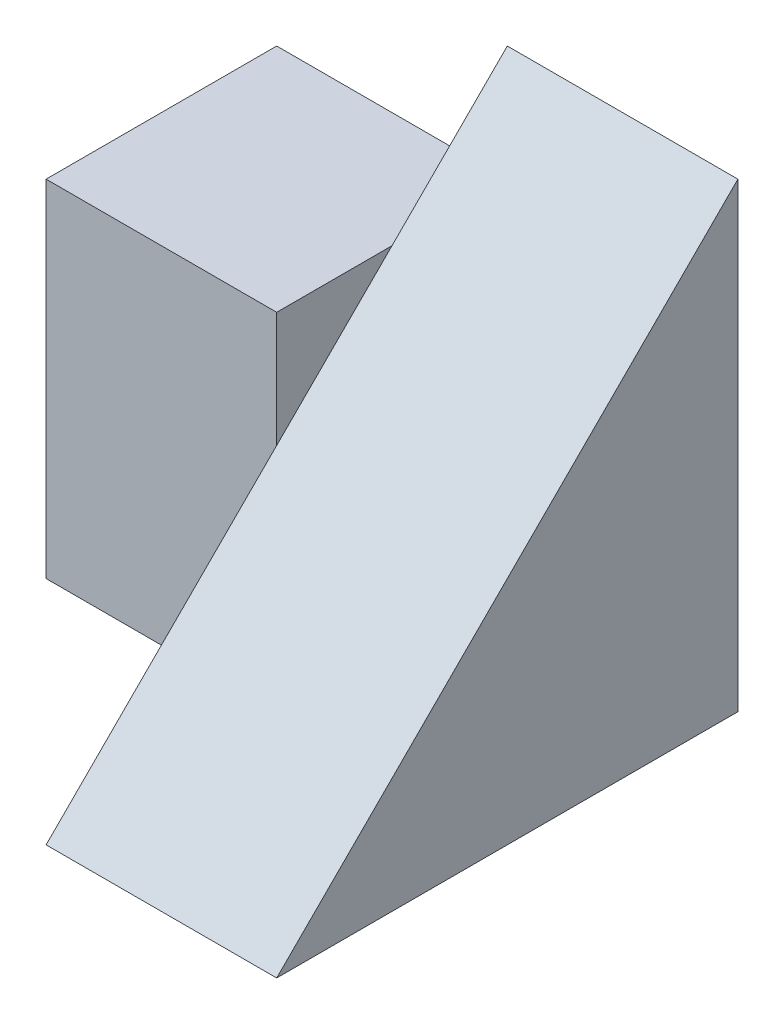
ISO-10303-21;
HEADER;
FILE_DESCRIPTION(('STEP AP214'),'2;1');
FILE_NAME('part.step','',(''),(''),'','','');
FILE_SCHEMA(('AUTOMOTIVE_DESIGN { 1 0 10303 214 1 1 1 1 }'));
ENDSEC;
DATA;
#1=APPLICATION_CONTEXT('core data for automotive mechanical design processes');
#2=APPLICATION_PROTOCOL_DEFINITION('international standard','automotive_design',2000,#1);
#3=PRODUCT_CONTEXT('',#1,'mechanical');
#4=PRODUCT('Part','Part','',(#3));
#5=PRODUCT_RELATED_PRODUCT_CATEGORY('part','',(#4));
#6=PRODUCT_DEFINITION_FORMATION('','',#4);
#7=PRODUCT_DEFINITION_CONTEXT('part definition',#1,'design');
#8=PRODUCT_DEFINITION('design','',#6,#7);
#9=PRODUCT_DEFINITION_SHAPE('','',#8);
#10=(LENGTH_UNIT() NAMED_UNIT(*) SI_UNIT(.MILLI.,.METRE.));
#11=(NAMED_UNIT(*) PLANE_ANGLE_UNIT() SI_UNIT($,.RADIAN.));
#12=(NAMED_UNIT(*) SI_UNIT($,.STERADIAN.) SOLID_ANGLE_UNIT());
#13=UNCERTAINTY_MEASURE_WITH_UNIT(LENGTH_MEASURE(1.E-05),#10,'distance_accuracy_value','');
#14=(GEOMETRIC_REPRESENTATION_CONTEXT(3) GLOBAL_UNCERTAINTY_ASSIGNED_CONTEXT((#13)) GLOBAL_UNIT_ASSIGNED_CONTEXT((#10,
#11,#12)) REPRESENTATION_CONTEXT('',''));
#15=CARTESIAN_POINT('',(0.,0.,0.));
#16=DIRECTION('',(0.,0.,1.));
#17=DIRECTION('',(1.,0.,0.));
#18=AXIS2_PLACEMENT_3D('',#15,#16,#17);
#19=CARTESIAN_POINT('',(0.,0.,0.));
#20=DIRECTION('',(-1.,0.,0.));
#21=DIRECTION('',(0.,0.,1.));
#22=AXIS2_PLACEMENT_3D('',#19,#20,#21);
#23=PLANE('',#22);
#24=DIRECTION('',(0.,0.707106781186548,-0.707106781186548));
#25=VECTOR('',#24,1.);
#26=CARTESIAN_POINT('',(0.,4.,-4.));
#27=LINE('',#26,#25);
#28=CARTESIAN_POINT('',(0.,3.,-3.));
#29=VERTEX_POINT('',#28);
#30=CARTESIAN_POINT('',(0.,4.,-4.));
#31=VERTEX_POINT('',#30);
#32=EDGE_CURVE('E100',#29,#31,#27,.T.);
#33=ORIENTED_EDGE('',*,*,#32,.T.);
#34=DIRECTION('',(0.,1.,0.));
#35=VECTOR('',#34,1.);
#36=CARTESIAN_POINT('',(0.,0.,-4.));
#37=LINE('',#36,#35);
#38=CARTESIAN_POINT('',(0.,3.,-4.));
#39=VERTEX_POINT('',#38);
#40=EDGE_CURVE('E106',#39,#31,#37,.T.);
#41=ORIENTED_EDGE('',*,*,#40,.F.);
#42=DIRECTION('',(0.,0.,-1.));
#43=VECTOR('',#42,1.);
#44=CARTESIAN_POINT('',(0.,3.,-4.));
#45=LINE('',#44,#43);
#46=EDGE_CURVE('E37',#29,#39,#45,.T.);
#47=ORIENTED_EDGE('',*,*,#46,.F.);
#48=EDGE_LOOP('',(#33,#41,#47));
#49=FACE_BOUND('',#48,.T.);
#50=ADVANCED_FACE('F33',(#49),#23,.T.);
#51=CARTESIAN_POINT('',(2.,0.,0.));
#52=DIRECTION('',(0.,1.,0.));
#53=DIRECTION('',(0.,0.,1.));
#54=AXIS2_PLACEMENT_3D('',#51,#52,#53);
#55=PLANE('',#54);
#56=DIRECTION('',(0.,0.,-1.));
#57=VECTOR('',#56,1.);
#58=CARTESIAN_POINT('',(0.,0.,0.));
#59=LINE('',#58,#57);
#60=CARTESIAN_POINT('',(0.,0.,0.));
#61=VERTEX_POINT('',#60);
#62=CARTESIAN_POINT('',(0.,0.,-2.));
#63=VERTEX_POINT('',#62);
#64=EDGE_CURVE('E101',#61,#63,#59,.T.);
#65=ORIENTED_EDGE('',*,*,#64,.T.);
#66=DIRECTION('',(1.,0.,0.));
#67=VECTOR('',#66,1.);
#68=CARTESIAN_POINT('',(-2.,0.,-2.));
#69=LINE('',#68,#67);
#70=CARTESIAN_POINT('',(-2.,0.,-2.));
#71=VERTEX_POINT('',#70);
#72=EDGE_CURVE('E107',#71,#63,#69,.T.);
#73=ORIENTED_EDGE('',*,*,#72,.F.);
#74=DIRECTION('',(0.,0.,1.));
#75=VECTOR('',#74,1.);
#76=CARTESIAN_POINT('',(-2.,0.,-4.));
#77=LINE('',#76,#75);
#78=CARTESIAN_POINT('',(-2.,0.,-4.));
#79=VERTEX_POINT('',#78);
#80=EDGE_CURVE('E148',#79,#71,#77,.T.);
#81=ORIENTED_EDGE('',*,*,#80,.F.);
#82=DIRECTION('',(-1.,0.,0.));
#83=VECTOR('',#82,1.);
#84=CARTESIAN_POINT('',(2.,0.,-4.));
#85=LINE('',#84,#83);
#86=CARTESIAN_POINT('',(2.,0.,-4.));
#87=VERTEX_POINT('',#86);
#88=EDGE_CURVE('E43',#87,#79,#85,.T.);
#89=ORIENTED_EDGE('',*,*,#88,.F.);
#90=DIRECTION('',(0.,0.,-1.));
#91=VECTOR('',#90,1.);
#92=CARTESIAN_POINT('',(2.,0.,0.));
#93=LINE('',#92,#91);
#94=CARTESIAN_POINT('',(2.,0.,0.));
#95=VERTEX_POINT('',#94);
#96=EDGE_CURVE('E111',#95,#87,#93,.T.);
#97=ORIENTED_EDGE('',*,*,#96,.F.);
#98=DIRECTION('',(-1.,0.,0.));
#99=VECTOR('',#98,1.);
#100=CARTESIAN_POINT('',(2.,0.,0.));
#101=LINE('',#100,#99);
#102=EDGE_CURVE('E11',#95,#61,#101,.T.);
#103=ORIENTED_EDGE('',*,*,#102,.T.);
#104=EDGE_LOOP('',(#65,#73,#81,#89,#97,#103));
#105=FACE_BOUND('',#104,.T.);
#106=ADVANCED_FACE('F35',(#105),#55,.F.);
#107=CARTESIAN_POINT('',(2.,0.,-4.));
#108=DIRECTION('',(0.,0.,1.));
#109=DIRECTION('',(1.,0.,0.));
#110=AXIS2_PLACEMENT_3D('',#107,#108,#109);
#111=PLANE('',#110);
#112=ORIENTED_EDGE('',*,*,#88,.T.);
#113=DIRECTION('',(0.,-1.,0.));
#114=VECTOR('',#113,1.);
#115=CARTESIAN_POINT('',(-2.,0.,-4.));
#116=LINE('',#115,#114);
#117=CARTESIAN_POINT('',(-2.,3.,-4.));
#118=VERTEX_POINT('',#117);
#119=EDGE_CURVE('E139',#118,#79,#116,.T.);
#120=ORIENTED_EDGE('',*,*,#119,.F.);
#121=DIRECTION('',(1.,0.,0.));
#122=VECTOR('',#121,1.);
#123=CARTESIAN_POINT('',(-2.,3.,-4.));
#124=LINE('',#123,#122);
#125=EDGE_CURVE('E140',#118,#39,#124,.T.);
#126=ORIENTED_EDGE('',*,*,#125,.T.);
#127=ORIENTED_EDGE('',*,*,#40,.T.);
#128=DIRECTION('',(-1.,0.,0.));
#129=VECTOR('',#128,1.);
#130=CARTESIAN_POINT('',(2.,4.,-4.));
#131=LINE('',#130,#129);
#132=CARTESIAN_POINT('',(2.,4.,-4.));
#133=VERTEX_POINT('',#132);
#134=EDGE_CURVE('E118',#133,#31,#131,.T.);
#135=ORIENTED_EDGE('',*,*,#134,.F.);
#136=DIRECTION('',(0.,1.,0.));
#137=VECTOR('',#136,1.);
#138=CARTESIAN_POINT('',(2.,0.,-4.));
#139=LINE('',#138,#137);
#140=EDGE_CURVE('E116',#87,#133,#139,.T.);
#141=ORIENTED_EDGE('',*,*,#140,.F.);
#142=EDGE_LOOP('',(#112,#120,#126,#127,#135,#141));
#143=FACE_BOUND('',#142,.T.);
#144=ADVANCED_FACE('F161',(#143),#111,.F.);
#145=CARTESIAN_POINT('',(2.,0.,0.));
#146=DIRECTION('',(-1.,0.,0.));
#147=DIRECTION('',(0.,0.,1.));
#148=AXIS2_PLACEMENT_3D('',#145,#146,#147);
#149=PLANE('',#148);
#150=ORIENTED_EDGE('',*,*,#140,.T.);
#151=DIRECTION('',(0.,0.707106781186548,-0.707106781186548));
#152=VECTOR('',#151,1.);
#153=CARTESIAN_POINT('',(2.,4.,-4.));
#154=LINE('',#153,#152);
#155=EDGE_CURVE('E153',#95,#133,#154,.T.);
#156=ORIENTED_EDGE('',*,*,#155,.F.);
#157=ORIENTED_EDGE('',*,*,#96,.T.);
#158=EDGE_LOOP('',(#150,#156,#157));
#159=FACE_BOUND('',#158,.T.);
#160=ADVANCED_FACE('F193',(#159),#149,.F.);
#161=CARTESIAN_POINT('',(0.,2.,-2.));
#162=VERTEX_POINT('',#161);
#163=EDGE_CURVE('E95',#61,#162,#27,.T.);
#164=ORIENTED_EDGE('',*,*,#163,.T.);
#165=DIRECTION('',(0.,1.,0.));
#166=VECTOR('',#165,1.);
#167=CARTESIAN_POINT('',(0.,0.,-2.));
#168=LINE('',#167,#166);
#169=EDGE_CURVE('E59',#63,#162,#168,.T.);
#170=ORIENTED_EDGE('',*,*,#169,.F.);
#171=ORIENTED_EDGE('',*,*,#64,.F.);
#172=EDGE_LOOP('',(#164,#170,#171));
#173=FACE_BOUND('',#172,.T.);
#174=ADVANCED_FACE('F102',(#173),#23,.T.);
#175=CARTESIAN_POINT('',(-2.,0.,-2.));
#176=DIRECTION('',(0.,0.,-1.));
#177=DIRECTION('',(-1.,0.,0.));
#178=AXIS2_PLACEMENT_3D('',#175,#176,#177);
#179=PLANE('',#178);
#180=ORIENTED_EDGE('',*,*,#169,.T.);
#181=DIRECTION('',(0.,-1.,0.));
#182=VECTOR('',#181,1.);
#183=CARTESIAN_POINT('',(0.,0.,-2.));
#184=LINE('',#183,#182);
#185=CARTESIAN_POINT('',(0.,3.,-2.));
#186=VERTEX_POINT('',#185);
#187=EDGE_CURVE('E98',#186,#162,#184,.T.);
#188=ORIENTED_EDGE('',*,*,#187,.F.);
#189=DIRECTION('',(1.,0.,0.));
#190=VECTOR('',#189,1.);
#191=CARTESIAN_POINT('',(-2.,3.,-2.));
#192=LINE('',#191,#190);
#193=CARTESIAN_POINT('',(-2.,3.,-2.));
#194=VERTEX_POINT('',#193);
#195=EDGE_CURVE('E123',#194,#186,#192,.T.);
#196=ORIENTED_EDGE('',*,*,#195,.F.);
#197=DIRECTION('',(0.,1.,0.));
#198=VECTOR('',#197,1.);
#199=CARTESIAN_POINT('',(-2.,0.,-2.));
#200=LINE('',#199,#198);
#201=EDGE_CURVE('E146',#71,#194,#200,.T.);
#202=ORIENTED_EDGE('',*,*,#201,.F.);
#203=ORIENTED_EDGE('',*,*,#72,.T.);
#204=EDGE_LOOP('',(#180,#188,#196,#202,#203));
#205=FACE_BOUND('',#204,.T.);
#206=ADVANCED_FACE('F172',(#205),#179,.F.);
#207=CARTESIAN_POINT('',(-2.,3.,-4.));
#208=DIRECTION('',(0.,-1.,0.));
#209=DIRECTION('',(0.,0.,-1.));
#210=AXIS2_PLACEMENT_3D('',#207,#208,#209);
#211=PLANE('',#210);
#212=EDGE_CURVE('E136',#186,#29,#45,.T.);
#213=ORIENTED_EDGE('',*,*,#212,.T.);
#214=ORIENTED_EDGE('',*,*,#46,.T.);
#215=ORIENTED_EDGE('',*,*,#125,.F.);
#216=DIRECTION('',(0.,0.,-1.));
#217=VECTOR('',#216,1.);
#218=CARTESIAN_POINT('',(-2.,3.,-4.));
#219=LINE('',#218,#217);
#220=EDGE_CURVE('E143',#194,#118,#219,.T.);
#221=ORIENTED_EDGE('',*,*,#220,.F.);
#222=ORIENTED_EDGE('',*,*,#195,.T.);
#223=EDGE_LOOP('',(#213,#214,#215,#221,#222));
#224=FACE_BOUND('',#223,.T.);
#225=ADVANCED_FACE('F168',(#224),#211,.F.);
#226=CARTESIAN_POINT('',(-2.,0.,0.));
#227=DIRECTION('',(1.,0.,0.));
#228=DIRECTION('',(0.,0.,-1.));
#229=AXIS2_PLACEMENT_3D('',#226,#227,#228);
#230=PLANE('',#229);
#231=ORIENTED_EDGE('',*,*,#119,.T.);
#232=ORIENTED_EDGE('',*,*,#80,.T.);
#233=ORIENTED_EDGE('',*,*,#201,.T.);
#234=ORIENTED_EDGE('',*,*,#220,.T.);
#235=EDGE_LOOP('',(#231,#232,#233,#234));
#236=FACE_BOUND('',#235,.T.);
#237=ADVANCED_FACE('F175',(#236),#230,.F.);
#238=CARTESIAN_POINT('',(0.,0.,0.));
#239=DIRECTION('',(1.,0.,0.));
#240=DIRECTION('',(0.,0.,-1.));
#241=AXIS2_PLACEMENT_3D('',#238,#239,#240);
#242=PLANE('',#241);
#243=ORIENTED_EDGE('',*,*,#187,.T.);
#244=EDGE_CURVE('E51',#162,#29,#27,.T.);
#245=ORIENTED_EDGE('',*,*,#244,.T.);
#246=ORIENTED_EDGE('',*,*,#212,.F.);
#247=EDGE_LOOP('',(#243,#245,#246));
#248=FACE_BOUND('',#247,.T.);
#249=ADVANCED_FACE('F173',(#248),#242,.T.);
#250=CARTESIAN_POINT('',(0.,4.,-4.));
#251=DIRECTION('',(0.,-0.707106781186547,-0.707106781186547));
#252=DIRECTION('',(0.,0.707106781186548,-0.707106781186548));
#253=AXIS2_PLACEMENT_3D('',#250,#251,#252);
#254=PLANE('',#253);
#255=ORIENTED_EDGE('',*,*,#155,.T.);
#256=ORIENTED_EDGE('',*,*,#134,.T.);
#257=ORIENTED_EDGE('',*,*,#32,.F.);
#258=ORIENTED_EDGE('',*,*,#244,.F.);
#259=ORIENTED_EDGE('',*,*,#163,.F.);
#260=ORIENTED_EDGE('',*,*,#102,.F.);
#261=EDGE_LOOP('',(#255,#256,#257,#258,#259,#260));
#262=FACE_BOUND('',#261,.T.);
#263=ADVANCED_FACE('F96',(#262),#254,.F.);
#264=CLOSED_SHELL('',(#50,#106,#144,#160,#174,#206,#225,#237,#249,#263));
#265=MANIFOLD_SOLID_BREP('B2',#264);
#266=ADVANCED_BREP_SHAPE_REPRESENTATION('',(#18,#265),#14);
#267=SHAPE_DEFINITION_REPRESENTATION(#9,#266);
ENDSEC;
END-ISO-10303-21;
